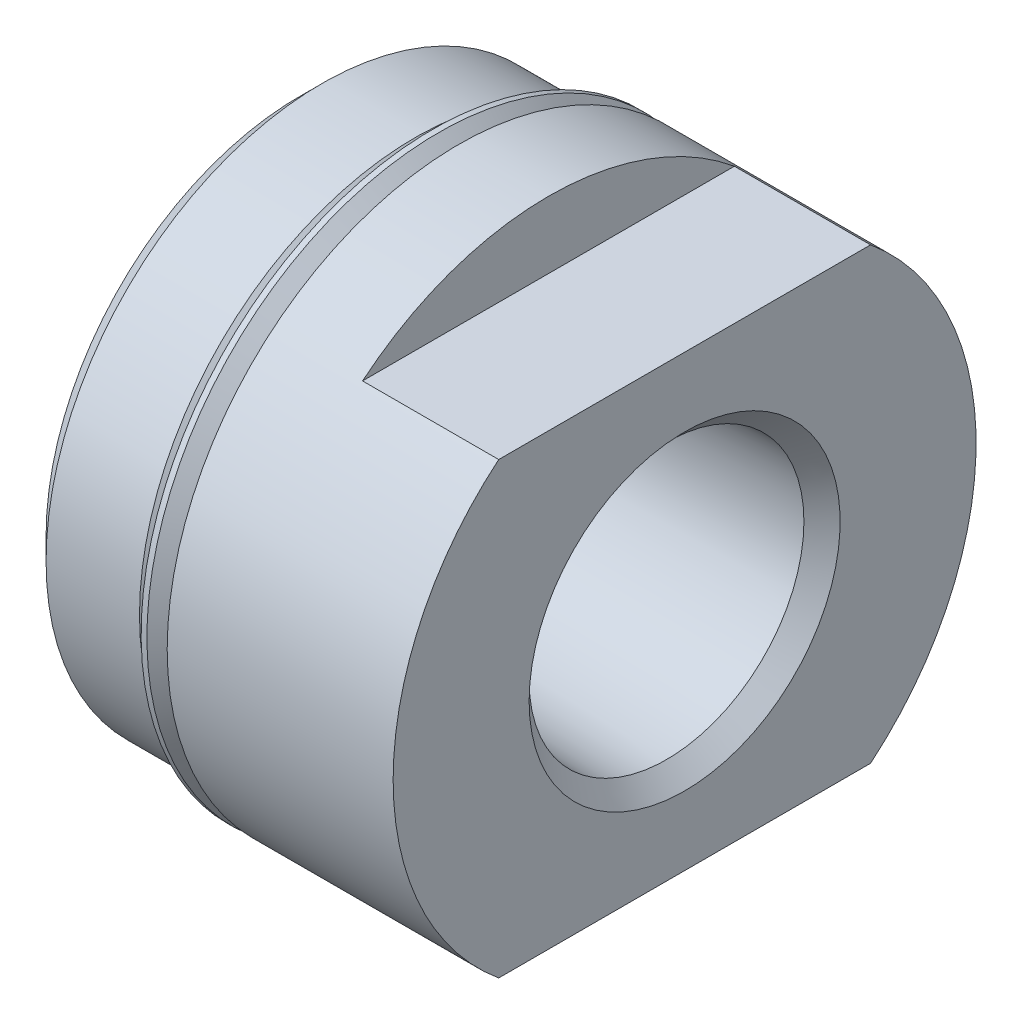
ISO-10303-21;
HEADER;
FILE_DESCRIPTION(('STEP AP214'),'2;1');
FILE_NAME('part.step','',(''),(''),'','','');
FILE_SCHEMA(('AUTOMOTIVE_DESIGN { 1 0 10303 214 1 1 1 1 }'));
ENDSEC;
DATA;
#1=APPLICATION_CONTEXT('core data for automotive mechanical design processes');
#2=APPLICATION_PROTOCOL_DEFINITION('international standard','automotive_design',2000,#1);
#3=PRODUCT_CONTEXT('',#1,'mechanical');
#4=PRODUCT('Part','Part','',(#3));
#5=PRODUCT_RELATED_PRODUCT_CATEGORY('part','',(#4));
#6=PRODUCT_DEFINITION_FORMATION('','',#4);
#7=PRODUCT_DEFINITION_CONTEXT('part definition',#1,'design');
#8=PRODUCT_DEFINITION('design','',#6,#7);
#9=PRODUCT_DEFINITION_SHAPE('','',#8);
#10=(LENGTH_UNIT() NAMED_UNIT(*) SI_UNIT(.MILLI.,.METRE.));
#11=(NAMED_UNIT(*) PLANE_ANGLE_UNIT() SI_UNIT($,.RADIAN.));
#12=(NAMED_UNIT(*) SI_UNIT($,.STERADIAN.) SOLID_ANGLE_UNIT());
#13=UNCERTAINTY_MEASURE_WITH_UNIT(LENGTH_MEASURE(1.E-05),#10,'distance_accuracy_value','');
#14=(GEOMETRIC_REPRESENTATION_CONTEXT(3) GLOBAL_UNCERTAINTY_ASSIGNED_CONTEXT((#13)) GLOBAL_UNIT_ASSIGNED_CONTEXT((#10,
#11,#12)) REPRESENTATION_CONTEXT('',''));
#15=CARTESIAN_POINT('',(0.,0.,0.));
#16=DIRECTION('',(0.,0.,1.));
#17=DIRECTION('',(1.,0.,0.));
#18=AXIS2_PLACEMENT_3D('',#15,#16,#17);
#19=CARTESIAN_POINT('',(13.4874,0.,0.));
#20=DIRECTION('',(-1.,0.,0.));
#21=DIRECTION('',(0.,0.,1.));
#22=AXIS2_PLACEMENT_3D('',#19,#20,#21);
#23=CYLINDRICAL_SURFACE('',#22,8.90905);
#24=CARTESIAN_POINT('',(4.8006,0.,0.));
#25=DIRECTION('',(-1.,0.,0.));
#26=DIRECTION('',(0.,0.,1.));
#27=AXIS2_PLACEMENT_3D('',#24,#25,#26);
#28=CIRCLE('',#27,8.90905);
#29=CARTESIAN_POINT('',(4.8006,0.,8.90905));
#30=VERTEX_POINT('',#29);
#31=EDGE_CURVE('E113',#30,#30,#28,.T.);
#32=ORIENTED_EDGE('',*,*,#31,.F.);
#33=EDGE_LOOP('',(#32));
#34=FACE_BOUND('',#33,.T.);
#35=CARTESIAN_POINT('',(5.18159999999989,0.,0.));
#36=DIRECTION('',(1.,0.,0.));
#37=DIRECTION('',(0.,1.,0.));
#38=AXIS2_PLACEMENT_3D('',#35,#36,#37);
#39=CIRCLE('',#38,8.90905);
#40=CARTESIAN_POINT('',(5.18159999999996,8.90904999999996,0.));
#41=VERTEX_POINT('',#40);
#42=EDGE_CURVE('E11',#41,#41,#39,.T.);
#43=ORIENTED_EDGE('',*,*,#42,.F.);
#44=EDGE_LOOP('',(#43));
#45=FACE_BOUND('',#44,.T.);
#46=ADVANCED_FACE('F38',(#34,#45),#23,.T.);
#47=CARTESIAN_POINT('',(5.5626,8.90905,0.));
#48=DIRECTION('',(1.,0.,0.));
#49=DIRECTION('',(0.,0.,-1.));
#50=AXIS2_PLACEMENT_3D('',#47,#48,#49);
#51=PLANE('',#50);
#52=CARTESIAN_POINT('',(5.5626,0.,0.));
#53=DIRECTION('',(-1.,0.,0.));
#54=DIRECTION('',(0.,0.,1.));
#55=AXIS2_PLACEMENT_3D('',#52,#53,#54);
#56=CIRCLE('',#55,10.2235);
#57=CARTESIAN_POINT('',(5.5626,0.,10.2235));
#58=VERTEX_POINT('',#57);
#59=EDGE_CURVE('E104',#58,#58,#56,.T.);
#60=ORIENTED_EDGE('',*,*,#59,.T.);
#61=EDGE_LOOP('',(#60));
#62=FACE_BOUND('',#61,.T.);
#63=CARTESIAN_POINT('',(5.5626,0.,0.));
#64=DIRECTION('',(1.,0.,0.));
#65=DIRECTION('',(0.,0.,-1.));
#66=AXIS2_PLACEMENT_3D('',#63,#64,#65);
#67=CIRCLE('',#66,9.51204893040247);
#68=CARTESIAN_POINT('',(5.5626,0.,-9.51204893040254));
#69=VERTEX_POINT('',#68);
#70=EDGE_CURVE('E46',#69,#69,#67,.F.);
#71=ORIENTED_EDGE('',*,*,#70,.F.);
#72=EDGE_LOOP('',(#71));
#73=FACE_BOUND('',#72,.T.);
#74=ADVANCED_FACE('F135',(#62,#73),#51,.F.);
#75=CARTESIAN_POINT('',(13.4874,10.2235,0.));
#76=DIRECTION('',(-1.,0.,0.));
#77=DIRECTION('',(0.,0.,1.));
#78=AXIS2_PLACEMENT_3D('',#75,#76,#77);
#79=PLANE('',#78);
#80=CARTESIAN_POINT('',(13.4874000000002,0.,0.));
#81=DIRECTION('',(-1.,0.,0.));
#82=DIRECTION('',(0.,0.,1.));
#83=AXIS2_PLACEMENT_3D('',#80,#81,#82);
#84=CIRCLE('',#83,5.45466392515005);
#85=CARTESIAN_POINT('',(13.4874000000002,0.,5.45466392515005));
#86=VERTEX_POINT('',#85);
#87=EDGE_CURVE('E198',#86,#86,#84,.T.);
#88=ORIENTED_EDGE('',*,*,#87,.T.);
#89=EDGE_LOOP('',(#88));
#90=FACE_BOUND('',#89,.T.);
#91=DIRECTION('',(0.,0.,1.));
#92=VECTOR('',#91,1.);
#93=CARTESIAN_POINT('',(13.4874,7.874,-20.447));
#94=LINE('',#93,#92);
#95=CARTESIAN_POINT('',(13.4874,7.874,-6.52074200149032));
#96=VERTEX_POINT('',#95);
#97=CARTESIAN_POINT('',(13.4874,7.874,6.52074200149032));
#98=VERTEX_POINT('',#97);
#99=EDGE_CURVE('E87',#96,#98,#94,.T.);
#100=ORIENTED_EDGE('',*,*,#99,.T.);
#101=CARTESIAN_POINT('',(13.4874,0.,0.));
#102=DIRECTION('',(-1.,0.,0.));
#103=DIRECTION('',(0.,0.,1.));
#104=AXIS2_PLACEMENT_3D('',#101,#102,#103);
#105=CIRCLE('',#104,10.2235);
#106=CARTESIAN_POINT('',(13.4874,-7.874,6.52074200149032));
#107=VERTEX_POINT('',#106);
#108=EDGE_CURVE('E95',#107,#98,#105,.T.);
#109=ORIENTED_EDGE('',*,*,#108,.F.);
#110=DIRECTION('',(0.,0.,-1.));
#111=VECTOR('',#110,1.);
#112=CARTESIAN_POINT('',(13.4874,-7.874,20.447));
#113=LINE('',#112,#111);
#114=CARTESIAN_POINT('',(13.4874,-7.874,-6.52074200149032));
#115=VERTEX_POINT('',#114);
#116=EDGE_CURVE('E77',#107,#115,#113,.T.);
#117=ORIENTED_EDGE('',*,*,#116,.T.);
#118=EDGE_CURVE('E101',#96,#115,#105,.T.);
#119=ORIENTED_EDGE('',*,*,#118,.F.);
#120=EDGE_LOOP('',(#100,#109,#117,#119));
#121=FACE_BOUND('',#120,.T.);
#122=ADVANCED_FACE('F100',(#90,#121),#79,.F.);
#123=CARTESIAN_POINT('',(13.4874,0.,0.));
#124=DIRECTION('',(-1.,0.,0.));
#125=DIRECTION('',(0.,0.,1.));
#126=AXIS2_PLACEMENT_3D('',#123,#124,#125);
#127=CYLINDRICAL_SURFACE('',#126,10.2235);
#128=ORIENTED_EDGE('',*,*,#59,.F.);
#129=EDGE_LOOP('',(#128));
#130=FACE_BOUND('',#129,.T.);
#131=DIRECTION('',(-1.,0.,0.));
#132=VECTOR('',#131,1.);
#133=CARTESIAN_POINT('',(13.4874,7.874,-6.52074200149032));
#134=LINE('',#133,#132);
#135=CARTESIAN_POINT('',(8.7122,7.874,-6.52074200149032));
#136=VERTEX_POINT('',#135);
#137=EDGE_CURVE('E129',#96,#136,#134,.T.);
#138=ORIENTED_EDGE('',*,*,#137,.F.);
#139=ORIENTED_EDGE('',*,*,#118,.T.);
#140=DIRECTION('',(-1.,0.,0.));
#141=VECTOR('',#140,1.);
#142=CARTESIAN_POINT('',(13.4874,-7.874,-6.52074200149032));
#143=LINE('',#142,#141);
#144=CARTESIAN_POINT('',(8.7122,-7.874,-6.52074200149032));
#145=VERTEX_POINT('',#144);
#146=EDGE_CURVE('E82',#145,#115,#143,.F.);
#147=ORIENTED_EDGE('',*,*,#146,.F.);
#148=CARTESIAN_POINT('',(8.7122,0.,0.));
#149=DIRECTION('',(1.,0.,0.));
#150=DIRECTION('',(0.,0.,-1.));
#151=AXIS2_PLACEMENT_3D('',#148,#149,#150);
#152=CIRCLE('',#151,10.2235);
#153=CARTESIAN_POINT('',(8.7122,-7.874,6.52074200149032));
#154=VERTEX_POINT('',#153);
#155=EDGE_CURVE('E96',#154,#145,#152,.T.);
#156=ORIENTED_EDGE('',*,*,#155,.F.);
#157=DIRECTION('',(-1.,0.,0.));
#158=VECTOR('',#157,1.);
#159=CARTESIAN_POINT('',(13.4874,-7.874,6.52074200149032));
#160=LINE('',#159,#158);
#161=EDGE_CURVE('E80',#107,#154,#160,.T.);
#162=ORIENTED_EDGE('',*,*,#161,.F.);
#163=ORIENTED_EDGE('',*,*,#108,.T.);
#164=DIRECTION('',(-1.,0.,0.));
#165=VECTOR('',#164,1.);
#166=CARTESIAN_POINT('',(13.4874,7.874,6.52074200149032));
#167=LINE('',#166,#165);
#168=CARTESIAN_POINT('',(8.7122,7.874,6.52074200149032));
#169=VERTEX_POINT('',#168);
#170=EDGE_CURVE('E97',#169,#98,#167,.F.);
#171=ORIENTED_EDGE('',*,*,#170,.F.);
#172=EDGE_CURVE('E126',#136,#169,#152,.T.);
#173=ORIENTED_EDGE('',*,*,#172,.F.);
#174=EDGE_LOOP('',(#138,#139,#147,#156,#162,#163,#171,#173));
#175=FACE_BOUND('',#174,.T.);
#176=ADVANCED_FACE('F93',(#130,#175),#127,.T.);
#177=CARTESIAN_POINT('',(0.,0.,0.));
#178=DIRECTION('',(1.,0.,0.));
#179=DIRECTION('',(0.,0.,-1.));
#180=AXIS2_PLACEMENT_3D('',#177,#178,#179);
#181=PLANE('',#180);
#182=CARTESIAN_POINT('',(0.,0.,0.));
#183=DIRECTION('',(-1.,0.,0.));
#184=DIRECTION('',(0.,0.,1.));
#185=AXIS2_PLACEMENT_3D('',#182,#183,#184);
#186=CIRCLE('',#185,8.90905);
#187=CARTESIAN_POINT('',(0.,0.,8.90905));
#188=VERTEX_POINT('',#187);
#189=EDGE_CURVE('E122',#188,#188,#186,.T.);
#190=ORIENTED_EDGE('',*,*,#189,.T.);
#191=EDGE_LOOP('',(#190));
#192=FACE_BOUND('',#191,.T.);
#193=CARTESIAN_POINT('',(0.,0.,0.));
#194=DIRECTION('',(1.,0.,0.));
#195=DIRECTION('',(0.,0.,-1.));
#196=AXIS2_PLACEMENT_3D('',#193,#194,#195);
#197=CIRCLE('',#196,4.41840547597906);
#198=CARTESIAN_POINT('',(0.,0.,-4.41840547597906));
#199=VERTEX_POINT('',#198);
#200=EDGE_CURVE('E102',#199,#199,#197,.F.);
#201=ORIENTED_EDGE('',*,*,#200,.F.);
#202=EDGE_LOOP('',(#201));
#203=FACE_BOUND('',#202,.T.);
#204=ADVANCED_FACE('F40',(#192,#203),#181,.F.);
#205=CARTESIAN_POINT('',(0.762000000000001,0.,0.));
#206=DIRECTION('',(1.,0.,0.));
#207=DIRECTION('',(0.,0.,-1.));
#208=AXIS2_PLACEMENT_3D('',#205,#206,#207);
#209=CONICAL_SURFACE('',#208,9.67105,0.785398163397447);
#210=ORIENTED_EDGE('',*,*,#189,.F.);
#211=EDGE_LOOP('',(#210));
#212=FACE_BOUND('',#211,.T.);
#213=CARTESIAN_POINT('',(0.762000000000001,0.,0.));
#214=DIRECTION('',(-1.,0.,0.));
#215=DIRECTION('',(0.,0.,1.));
#216=AXIS2_PLACEMENT_3D('',#213,#214,#215);
#217=CIRCLE('',#216,9.67105);
#218=CARTESIAN_POINT('',(0.762000000000001,0.,9.67105));
#219=VERTEX_POINT('',#218);
#220=EDGE_CURVE('E119',#219,#219,#217,.T.);
#221=ORIENTED_EDGE('',*,*,#220,.T.);
#222=EDGE_LOOP('',(#221));
#223=FACE_BOUND('',#222,.T.);
#224=ADVANCED_FACE('F156',(#212,#223),#209,.T.);
#225=CARTESIAN_POINT('',(13.4874,0.,0.));
#226=DIRECTION('',(-1.,0.,0.));
#227=DIRECTION('',(0.,0.,1.));
#228=AXIS2_PLACEMENT_3D('',#225,#226,#227);
#229=CYLINDRICAL_SURFACE('',#228,9.67105);
#230=ORIENTED_EDGE('',*,*,#220,.F.);
#231=EDGE_LOOP('',(#230));
#232=FACE_BOUND('',#231,.T.);
#233=CARTESIAN_POINT('',(4.0386,0.,0.));
#234=DIRECTION('',(-1.,0.,0.));
#235=DIRECTION('',(0.,0.,1.));
#236=AXIS2_PLACEMENT_3D('',#233,#234,#235);
#237=CIRCLE('',#236,9.67105);
#238=CARTESIAN_POINT('',(4.0386,0.,9.67105));
#239=VERTEX_POINT('',#238);
#240=EDGE_CURVE('E116',#239,#239,#237,.T.);
#241=ORIENTED_EDGE('',*,*,#240,.T.);
#242=EDGE_LOOP('',(#241));
#243=FACE_BOUND('',#242,.T.);
#244=ADVANCED_FACE('F153',(#232,#243),#229,.T.);
#245=CARTESIAN_POINT('',(4.8006,0.,0.));
#246=DIRECTION('',(-1.,0.,0.));
#247=DIRECTION('',(0.,0.,1.));
#248=AXIS2_PLACEMENT_3D('',#245,#246,#247);
#249=CONICAL_SURFACE('',#248,8.90905,0.785398163397447);
#250=ORIENTED_EDGE('',*,*,#240,.F.);
#251=EDGE_LOOP('',(#250));
#252=FACE_BOUND('',#251,.T.);
#253=ORIENTED_EDGE('',*,*,#31,.T.);
#254=EDGE_LOOP('',(#253));
#255=FACE_BOUND('',#254,.T.);
#256=ADVANCED_FACE('F149',(#252,#255),#249,.T.);
#257=CARTESIAN_POINT('',(12.852387191015,0.,0.));
#258=DIRECTION('',(1.,0.,0.));
#259=DIRECTION('',(0.,0.,-1.));
#260=AXIS2_PLACEMENT_3D('',#257,#258,#259);
#261=CONICAL_SURFACE('',#260,4.8196511161649,0.0312094049979799);
#262=CARTESIAN_POINT('',(12.852387191015,0.,0.));
#263=DIRECTION('',(-1.,0.,0.));
#264=DIRECTION('',(0.,0.,1.));
#265=AXIS2_PLACEMENT_3D('',#262,#263,#264);
#266=CIRCLE('',#265,4.8196511161649);
#267=CARTESIAN_POINT('',(12.852387191015,0.,4.8196511161649));
#268=VERTEX_POINT('',#267);
#269=EDGE_CURVE('E106',#268,#268,#266,.T.);
#270=ORIENTED_EDGE('',*,*,#269,.F.);
#271=EDGE_LOOP('',(#270));
#272=FACE_BOUND('',#271,.T.);
#273=ORIENTED_EDGE('',*,*,#200,.T.);
#274=EDGE_LOOP('',(#273));
#275=FACE_BOUND('',#274,.T.);
#276=ADVANCED_FACE('F152',(#272,#275),#261,.F.);
#277=CARTESIAN_POINT('',(13.4874000000002,0.,0.));
#278=DIRECTION('',(1.,0.,0.));
#279=DIRECTION('',(0.,0.,-1.));
#280=AXIS2_PLACEMENT_3D('',#277,#278,#279);
#281=CONICAL_SURFACE('',#280,5.45466392515005,0.785398163397449);
#282=ORIENTED_EDGE('',*,*,#269,.T.);
#283=EDGE_LOOP('',(#282));
#284=FACE_BOUND('',#283,.T.);
#285=ORIENTED_EDGE('',*,*,#87,.F.);
#286=EDGE_LOOP('',(#285));
#287=FACE_BOUND('',#286,.T.);
#288=ADVANCED_FACE('F204',(#284,#287),#281,.F.);
#289=CARTESIAN_POINT('',(8.7122,-7.874,20.447));
#290=DIRECTION('',(0.,-1.,0.));
#291=DIRECTION('',(0.,0.,-1.));
#292=AXIS2_PLACEMENT_3D('',#289,#290,#291);
#293=PLANE('',#292);
#294=ORIENTED_EDGE('',*,*,#161,.T.);
#295=DIRECTION('',(0.,0.,-1.));
#296=VECTOR('',#295,1.);
#297=CARTESIAN_POINT('',(8.7122,-7.874,20.447));
#298=LINE('',#297,#296);
#299=EDGE_CURVE('E61',#154,#145,#298,.T.);
#300=ORIENTED_EDGE('',*,*,#299,.T.);
#301=ORIENTED_EDGE('',*,*,#146,.T.);
#302=ORIENTED_EDGE('',*,*,#116,.F.);
#303=EDGE_LOOP('',(#294,#300,#301,#302));
#304=FACE_BOUND('',#303,.T.);
#305=ADVANCED_FACE('F79',(#304),#293,.T.);
#306=CARTESIAN_POINT('',(8.7122,0.,0.));
#307=DIRECTION('',(1.,0.,0.));
#308=DIRECTION('',(0.,0.,-1.));
#309=AXIS2_PLACEMENT_3D('',#306,#307,#308);
#310=PLANE('',#309);
#311=ORIENTED_EDGE('',*,*,#155,.T.);
#312=ORIENTED_EDGE('',*,*,#299,.F.);
#313=EDGE_LOOP('',(#311,#312));
#314=FACE_BOUND('',#313,.T.);
#315=ADVANCED_FACE('F221',(#314),#310,.T.);
#316=ORIENTED_EDGE('',*,*,#172,.T.);
#317=DIRECTION('',(0.,0.,1.));
#318=VECTOR('',#317,1.);
#319=CARTESIAN_POINT('',(8.7122,7.874,-20.447));
#320=LINE('',#319,#318);
#321=EDGE_CURVE('E53',#136,#169,#320,.T.);
#322=ORIENTED_EDGE('',*,*,#321,.F.);
#323=EDGE_LOOP('',(#316,#322));
#324=FACE_BOUND('',#323,.T.);
#325=ADVANCED_FACE('F217',(#324),#310,.T.);
#326=CARTESIAN_POINT('',(8.7122,7.874,-20.447));
#327=DIRECTION('',(0.,1.,0.));
#328=DIRECTION('',(0.,0.,1.));
#329=AXIS2_PLACEMENT_3D('',#326,#327,#328);
#330=PLANE('',#329);
#331=ORIENTED_EDGE('',*,*,#137,.T.);
#332=ORIENTED_EDGE('',*,*,#321,.T.);
#333=ORIENTED_EDGE('',*,*,#170,.T.);
#334=ORIENTED_EDGE('',*,*,#99,.F.);
#335=EDGE_LOOP('',(#331,#332,#333,#334));
#336=FACE_BOUND('',#335,.T.);
#337=ADVANCED_FACE('F220',(#336),#330,.T.);
#338=CARTESIAN_POINT('',(4.6479489304025,10.2235,0.));
#339=DIRECTION('',(1.,0.,0.));
#340=DIRECTION('',(0.,1.,0.));
#341=AXIS2_PLACEMENT_3D('',#338,#339,#340);
#342=PLANE('',#341);
#343=CARTESIAN_POINT('',(4.64794893040243,0.,0.));
#344=DIRECTION('',(-1.,0.,0.));
#345=DIRECTION('',(0.,-1.,0.));
#346=AXIS2_PLACEMENT_3D('',#343,#344,#345);
#347=CIRCLE('',#346,10.139331804126);
#348=CARTESIAN_POINT('',(4.64794893040235,-10.1393318041261,0.));
#349=VERTEX_POINT('',#348);
#350=EDGE_CURVE('E190',#349,#349,#347,.T.);
#351=ORIENTED_EDGE('',*,*,#350,.F.);
#352=EDGE_LOOP('',(#351));
#353=FACE_BOUND('',#352,.T.);
#354=CARTESIAN_POINT('',(4.64794893040242,0.,0.));
#355=DIRECTION('',(-1.,0.,0.));
#356=DIRECTION('',(0.,-1.,0.));
#357=AXIS2_PLACEMENT_3D('',#354,#355,#356);
#358=CIRCLE('',#357,10.2235);
#359=CARTESIAN_POINT('',(4.64794893040235,-10.2235000000001,0.));
#360=VERTEX_POINT('',#359);
#361=EDGE_CURVE('E187',#360,#360,#358,.T.);
#362=ORIENTED_EDGE('',*,*,#361,.T.);
#363=EDGE_LOOP('',(#362));
#364=FACE_BOUND('',#363,.T.);
#365=ADVANCED_FACE('F225',(#353,#364),#342,.F.);
#366=CARTESIAN_POINT('',(5.5625999999999,0.,0.));
#367=DIRECTION('',(-1.,0.,0.));
#368=DIRECTION('',(0.,-1.,0.));
#369=AXIS2_PLACEMENT_3D('',#366,#367,#368);
#370=CYLINDRICAL_SURFACE('',#369,10.2235);
#371=ORIENTED_EDGE('',*,*,#361,.F.);
#372=EDGE_LOOP('',(#371));
#373=FACE_BOUND('',#372,.T.);
#374=CARTESIAN_POINT('',(4.85114893040242,0.,0.));
#375=DIRECTION('',(-1.,0.,0.));
#376=DIRECTION('',(0.,-1.,0.));
#377=AXIS2_PLACEMENT_3D('',#374,#375,#376);
#378=CIRCLE('',#377,10.2235);
#379=CARTESIAN_POINT('',(4.85114893040235,-10.2235000000001,0.));
#380=VERTEX_POINT('',#379);
#381=EDGE_CURVE('E183',#380,#380,#378,.T.);
#382=ORIENTED_EDGE('',*,*,#381,.T.);
#383=EDGE_LOOP('',(#382));
#384=FACE_BOUND('',#383,.T.);
#385=ADVANCED_FACE('F230',(#373,#384),#370,.T.);
#386=CARTESIAN_POINT('',(5.56259999999993,0.,0.));
#387=DIRECTION('',(-1.,0.,0.));
#388=DIRECTION('',(0.,-1.,0.));
#389=AXIS2_PLACEMENT_3D('',#386,#387,#388);
#390=CONICAL_SURFACE('',#389,9.51204893040254,0.785398163397441);
#391=ORIENTED_EDGE('',*,*,#381,.F.);
#392=EDGE_LOOP('',(#391));
#393=FACE_BOUND('',#392,.T.);
#394=ORIENTED_EDGE('',*,*,#70,.T.);
#395=EDGE_LOOP('',(#394));
#396=FACE_BOUND('',#395,.T.);
#397=ADVANCED_FACE('F133',(#393,#396),#390,.T.);
#398=CARTESIAN_POINT('',(5.44011280605353,0.,0.));
#399=DIRECTION('',(1.,0.,0.));
#400=DIRECTION('',(0.,1.,0.));
#401=AXIS2_PLACEMENT_3D('',#398,#399,#400);
#402=CONICAL_SURFACE('',#401,9.16756280605364,0.785398163397455);
#403=ORIENTED_EDGE('',*,*,#42,.T.);
#404=EDGE_LOOP('',(#403));
#405=FACE_BOUND('',#404,.T.);
#406=CARTESIAN_POINT('',(5.44011280605353,0.,0.));
#407=DIRECTION('',(-1.,0.,0.));
#408=DIRECTION('',(0.,-1.,0.));
#409=AXIS2_PLACEMENT_3D('',#406,#407,#408);
#410=CIRCLE('',#409,9.16756280605364);
#411=CARTESIAN_POINT('',(5.44011280605346,-9.16756280605368,0.));
#412=VERTEX_POINT('',#411);
#413=EDGE_CURVE('E181',#412,#412,#410,.T.);
#414=ORIENTED_EDGE('',*,*,#413,.T.);
#415=EDGE_LOOP('',(#414));
#416=FACE_BOUND('',#415,.T.);
#417=ADVANCED_FACE('F174',(#405,#416),#402,.T.);
#418=CARTESIAN_POINT('',(5.35031024484292,0.,0.));
#419=DIRECTION('',(-1.,0.,0.));
#420=DIRECTION('',(0.,-1.,0.));
#421=AXIS2_PLACEMENT_3D('',#418,#419,#420);
#422=TOROIDAL_SURFACE('',#421,9.25736536726429,0.126999999999916);
#423=ORIENTED_EDGE('',*,*,#413,.F.);
#424=EDGE_LOOP('',(#423));
#425=FACE_BOUND('',#424,.T.);
#426=CARTESIAN_POINT('',(5.44011280605353,0.,0.));
#427=DIRECTION('',(-1.,0.,0.));
#428=DIRECTION('',(0.,-1.,0.));
#429=AXIS2_PLACEMENT_3D('',#426,#427,#428);
#430=CIRCLE('',#429,9.34716792847494);
#431=CARTESIAN_POINT('',(5.44011280605346,-9.34716792847498,0.));
#432=VERTEX_POINT('',#431);
#433=EDGE_CURVE('E184',#432,#432,#430,.T.);
#434=ORIENTED_EDGE('',*,*,#433,.T.);
#435=EDGE_LOOP('',(#434));
#436=FACE_BOUND('',#435,.T.);
#437=ADVANCED_FACE('F177',(#425,#436),#422,.F.);
#438=CARTESIAN_POINT('',(4.64794893040243,0.,0.));
#439=DIRECTION('',(-1.,0.,0.));
#440=DIRECTION('',(0.,-1.,0.));
#441=AXIS2_PLACEMENT_3D('',#438,#439,#440);
#442=CONICAL_SURFACE('',#441,10.139331804126,0.785398163397442);
#443=ORIENTED_EDGE('',*,*,#433,.F.);
#444=EDGE_LOOP('',(#443));
#445=FACE_BOUND('',#444,.T.);
#446=ORIENTED_EDGE('',*,*,#350,.T.);
#447=EDGE_LOOP('',(#446));
#448=FACE_BOUND('',#447,.T.);
#449=ADVANCED_FACE('F240',(#445,#448),#442,.F.);
#450=CLOSED_SHELL('',(#46,#74,#122,#176,#204,#224,#244,#256,#276,#288,#305,#315,#325,#337,#365,
#385,#397,#417,#437,#449));
#451=MANIFOLD_SOLID_BREP('B2',#450);
#452=ADVANCED_BREP_SHAPE_REPRESENTATION('',(#18,#451),#14);
#453=SHAPE_DEFINITION_REPRESENTATION(#9,#452);
ENDSEC;
END-ISO-10303-21;
